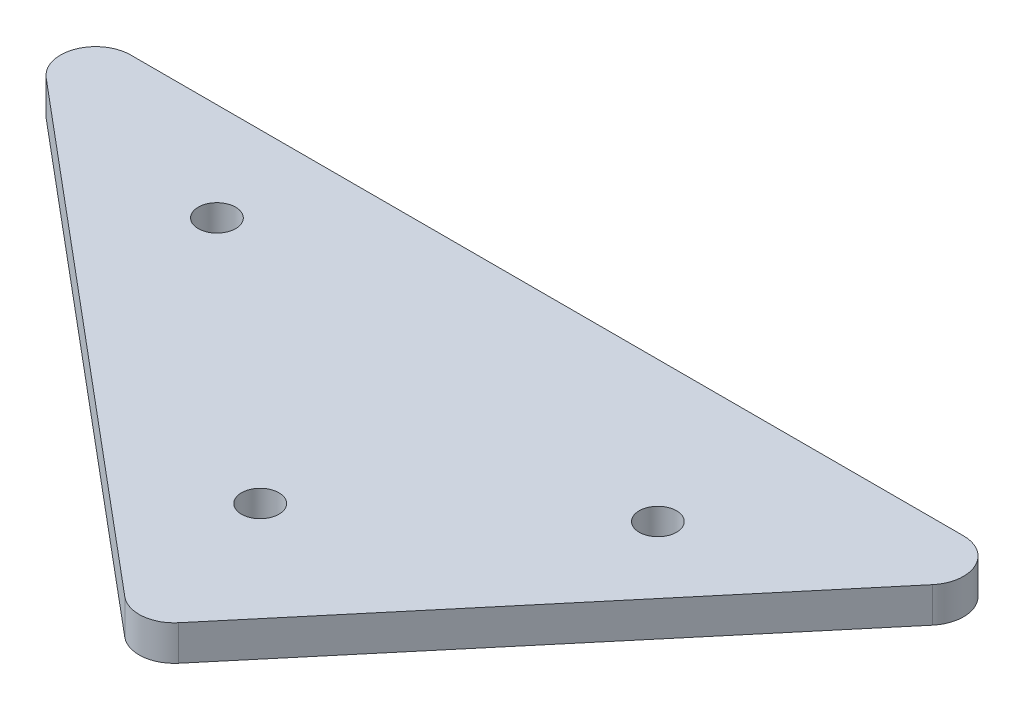
ISO-10303-21;
HEADER;
FILE_DESCRIPTION(('STEP AP214'),'2;1');
FILE_NAME('part.step','',(''),(''),'','','');
FILE_SCHEMA(('AUTOMOTIVE_DESIGN { 1 0 10303 214 1 1 1 1 }'));
ENDSEC;
DATA;
#1=APPLICATION_CONTEXT('core data for automotive mechanical design processes');
#2=APPLICATION_PROTOCOL_DEFINITION('international standard','automotive_design',2000,#1);
#3=PRODUCT_CONTEXT('',#1,'mechanical');
#4=PRODUCT('Part','Part','',(#3));
#5=PRODUCT_RELATED_PRODUCT_CATEGORY('part','',(#4));
#6=PRODUCT_DEFINITION_FORMATION('','',#4);
#7=PRODUCT_DEFINITION_CONTEXT('part definition',#1,'design');
#8=PRODUCT_DEFINITION('design','',#6,#7);
#9=PRODUCT_DEFINITION_SHAPE('','',#8);
#10=(LENGTH_UNIT() NAMED_UNIT(*) SI_UNIT(.MILLI.,.METRE.));
#11=(NAMED_UNIT(*) PLANE_ANGLE_UNIT() SI_UNIT($,.RADIAN.));
#12=(NAMED_UNIT(*) SI_UNIT($,.STERADIAN.) SOLID_ANGLE_UNIT());
#13=UNCERTAINTY_MEASURE_WITH_UNIT(LENGTH_MEASURE(1.E-05),#10,'distance_accuracy_value','');
#14=(GEOMETRIC_REPRESENTATION_CONTEXT(3) GLOBAL_UNCERTAINTY_ASSIGNED_CONTEXT((#13)) GLOBAL_UNIT_ASSIGNED_CONTEXT((#10,
#11,#12)) REPRESENTATION_CONTEXT('',''));
#15=CARTESIAN_POINT('',(0.,0.,0.));
#16=DIRECTION('',(0.,0.,1.));
#17=DIRECTION('',(1.,0.,0.));
#18=AXIS2_PLACEMENT_3D('',#15,#16,#17);
#19=CARTESIAN_POINT('',(189.795344434669,-158.75,127.));
#20=DIRECTION('',(0.,0.,1.));
#21=DIRECTION('',(1.,0.,0.));
#22=AXIS2_PLACEMENT_3D('',#19,#20,#21);
#23=PLANE('',#22);
#24=DIRECTION('',(-1.,0.,0.));
#25=VECTOR('',#24,1.);
#26=CARTESIAN_POINT('',(189.795344434669,-158.75,127.));
#27=LINE('',#26,#25);
#28=CARTESIAN_POINT('',(258.087229911123,-158.75,127.));
#29=VERTEX_POINT('',#28);
#30=CARTESIAN_POINT('',(107.476722517164,-158.75,127.));
#31=VERTEX_POINT('',#30);
#32=EDGE_CURVE('E106',#29,#31,#27,.T.);
#33=ORIENTED_EDGE('',*,*,#32,.F.);
#34=DIRECTION('',(0.,-1.,0.));
#35=VECTOR('',#34,1.);
#36=CARTESIAN_POINT('',(258.087229911123,-158.75,127.));
#37=LINE('',#36,#35);
#38=CARTESIAN_POINT('',(258.087229911123,-165.1,127.));
#39=VERTEX_POINT('',#38);
#40=EDGE_CURVE('E91',#29,#39,#37,.T.);
#41=ORIENTED_EDGE('',*,*,#40,.T.);
#42=DIRECTION('',(-1.,0.,0.));
#43=VECTOR('',#42,1.);
#44=CARTESIAN_POINT('',(189.795344434669,-165.1,127.));
#45=LINE('',#44,#43);
#46=CARTESIAN_POINT('',(107.476722517164,-165.1,127.));
#47=VERTEX_POINT('',#46);
#48=EDGE_CURVE('E104',#39,#47,#45,.T.);
#49=ORIENTED_EDGE('',*,*,#48,.T.);
#50=DIRECTION('',(0.,-1.,0.));
#51=VECTOR('',#50,1.);
#52=CARTESIAN_POINT('',(107.476722517164,-158.75,127.));
#53=LINE('',#52,#51);
#54=EDGE_CURVE('E109',#47,#31,#53,.F.);
#55=ORIENTED_EDGE('',*,*,#54,.T.);
#56=EDGE_LOOP('',(#33,#41,#49,#55));
#57=FACE_BOUND('',#56,.T.);
#58=ADVANCED_FACE('F16',(#57),#23,.F.);
#59=CARTESIAN_POINT('',(145.411840023669,-158.75,173.470679395635));
#60=DIRECTION('',(0.64278760968654,0.,-0.766044443118978));
#61=DIRECTION('',(-0.766044443118978,0.,-0.64278760968654));
#62=AXIS2_PLACEMENT_3D('',#59,#60,#61);
#63=PLANE('',#62);
#64=DIRECTION('',(0.766044443118978,0.,0.64278760968654));
#65=VECTOR('',#64,1.);
#66=CARTESIAN_POINT('',(145.411840023669,-165.1,173.470679395635));
#67=LINE('',#66,#65);
#68=CARTESIAN_POINT('',(103.395021195655,-165.1,138.214382213805));
#69=VERTEX_POINT('',#68);
#70=CARTESIAN_POINT('',(191.77689496586,-165.1,212.375579897142));
#71=VERTEX_POINT('',#70);
#72=EDGE_CURVE('E114',#69,#71,#67,.T.);
#73=ORIENTED_EDGE('',*,*,#72,.T.);
#74=DIRECTION('',(0.,-1.,0.));
#75=VECTOR('',#74,1.);
#76=CARTESIAN_POINT('',(191.77689496586,-158.75,212.375579897142));
#77=LINE('',#76,#75);
#78=CARTESIAN_POINT('',(191.77689496586,-158.75,212.375579897142));
#79=VERTEX_POINT('',#78);
#80=EDGE_CURVE('E11',#71,#79,#77,.F.);
#81=ORIENTED_EDGE('',*,*,#80,.T.);
#82=DIRECTION('',(0.766044443118978,0.,0.64278760968654));
#83=VECTOR('',#82,1.);
#84=CARTESIAN_POINT('',(145.411840023669,-158.75,173.470679395635));
#85=LINE('',#84,#83);
#86=CARTESIAN_POINT('',(103.395021195655,-158.75,138.214382213805));
#87=VERTEX_POINT('',#86);
#88=EDGE_CURVE('E143',#87,#79,#85,.T.);
#89=ORIENTED_EDGE('',*,*,#88,.F.);
#90=DIRECTION('',(0.,-1.,0.));
#91=VECTOR('',#90,1.);
#92=CARTESIAN_POINT('',(103.395021195655,-158.75,138.214382213805));
#93=LINE('',#92,#91);
#94=EDGE_CURVE('E25',#87,#69,#93,.T.);
#95=ORIENTED_EDGE('',*,*,#94,.T.);
#96=EDGE_LOOP('',(#73,#81,#89,#95));
#97=FACE_BOUND('',#96,.T.);
#98=ADVANCED_FACE('F164',(#97),#63,.F.);
#99=CARTESIAN_POINT('',(227.155076417816,-158.75,180.092351352888));
#100=DIRECTION('',(-0.766044443118978,0.,-0.64278760968654));
#101=DIRECTION('',(-0.64278760968654,0.,0.766044443118978));
#102=AXIS2_PLACEMENT_3D('',#99,#100,#101);
#103=PLANE('',#102);
#104=DIRECTION('',(0.64278760968654,0.,-0.766044443118978));
#105=VECTOR('',#104,1.);
#106=CARTESIAN_POINT('',(227.155076417816,-165.1,180.092351352888));
#107=LINE('',#106,#105);
#108=CARTESIAN_POINT('',(200.722978501176,-165.1,211.592899004846));
#109=VERTEX_POINT('',#108);
#110=CARTESIAN_POINT('',(262.951612124928,-165.1,137.431701321509));
#111=VERTEX_POINT('',#110);
#112=EDGE_CURVE('E115',#109,#111,#107,.T.);
#113=ORIENTED_EDGE('',*,*,#112,.T.);
#114=DIRECTION('',(0.,-1.,0.));
#115=VECTOR('',#114,1.);
#116=CARTESIAN_POINT('',(262.951612124928,-158.75,137.431701321509));
#117=LINE('',#116,#115);
#118=CARTESIAN_POINT('',(262.951612124928,-158.75,137.431701321509));
#119=VERTEX_POINT('',#118);
#120=EDGE_CURVE('E92',#111,#119,#117,.F.);
#121=ORIENTED_EDGE('',*,*,#120,.T.);
#122=DIRECTION('',(0.64278760968654,0.,-0.766044443118978));
#123=VECTOR('',#122,1.);
#124=CARTESIAN_POINT('',(227.155076417816,-158.75,180.092351352888));
#125=LINE('',#124,#123);
#126=CARTESIAN_POINT('',(200.722978501176,-158.75,211.592899004846));
#127=VERTEX_POINT('',#126);
#128=EDGE_CURVE('E121',#127,#119,#125,.T.);
#129=ORIENTED_EDGE('',*,*,#128,.F.);
#130=DIRECTION('',(0.,-1.,0.));
#131=VECTOR('',#130,1.);
#132=CARTESIAN_POINT('',(200.722978501176,-158.75,211.592899004846));
#133=LINE('',#132,#131);
#134=EDGE_CURVE('E98',#127,#109,#133,.T.);
#135=ORIENTED_EDGE('',*,*,#134,.T.);
#136=EDGE_LOOP('',(#113,#121,#129,#135));
#137=FACE_BOUND('',#136,.T.);
#138=ADVANCED_FACE('F172',(#137),#103,.F.);
#139=CARTESIAN_POINT('',(705.053366952356,-158.75,637.655198226429));
#140=DIRECTION('',(0.,1.,0.));
#141=DIRECTION('',(-1.,0.,0.));
#142=AXIS2_PLACEMENT_3D('',#139,#140,#141);
#143=PLANE('',#142);
#144=CARTESIAN_POINT('',(140.785030150917,-158.75,144.720316076102));
#145=DIRECTION('',(0.,1.,0.));
#146=DIRECTION('',(0.,0.,1.));
#147=AXIS2_PLACEMENT_3D('',#144,#145,#146);
#148=CIRCLE('',#147,3.3782);
#149=CARTESIAN_POINT('',(140.785030150917,-158.75,148.098516076102));
#150=VERTEX_POINT('',#149);
#151=EDGE_CURVE('E137',#150,#150,#148,.F.);
#152=ORIENTED_EDGE('',*,*,#151,.T.);
#153=EDGE_LOOP('',(#152));
#154=FACE_BOUND('',#153,.T.);
#155=CARTESIAN_POINT('',(228.210699023183,-158.75,152.4));
#156=DIRECTION('',(0.,1.,0.));
#157=DIRECTION('',(0.,0.,1.));
#158=AXIS2_PLACEMENT_3D('',#155,#156,#157);
#159=CIRCLE('',#158,3.3782);
#160=CARTESIAN_POINT('',(228.210699023183,-158.75,155.7782));
#161=VERTEX_POINT('',#160);
#162=EDGE_CURVE('E132',#161,#161,#159,.F.);
#163=ORIENTED_EDGE('',*,*,#162,.T.);
#164=EDGE_LOOP('',(#163));
#165=FACE_BOUND('',#164,.T.);
#166=CARTESIAN_POINT('',(189.428852288973,-158.75,185.537329291197));
#167=DIRECTION('',(0.,1.,0.));
#168=DIRECTION('',(0.,0.,1.));
#169=AXIS2_PLACEMENT_3D('',#166,#167,#168);
#170=CIRCLE('',#169,3.3782);
#171=CARTESIAN_POINT('',(189.428852288973,-158.75,188.915529291197));
#172=VERTEX_POINT('',#171);
#173=EDGE_CURVE('E124',#172,#172,#170,.F.);
#174=ORIENTED_EDGE('',*,*,#173,.T.);
#175=EDGE_LOOP('',(#174));
#176=FACE_BOUND('',#175,.T.);
#177=ORIENTED_EDGE('',*,*,#128,.T.);
#178=CARTESIAN_POINT('',(258.087229911123,-158.75,133.35));
#179=DIRECTION('',(0.,1.,0.));
#180=DIRECTION('',(0.,0.,1.));
#181=AXIS2_PLACEMENT_3D('',#178,#179,#180);
#182=CIRCLE('',#181,6.35);
#183=EDGE_CURVE('E158',#119,#29,#182,.T.);
#184=ORIENTED_EDGE('',*,*,#183,.T.);
#185=ORIENTED_EDGE('',*,*,#32,.T.);
#186=CARTESIAN_POINT('',(107.476722517164,-158.75,133.35));
#187=DIRECTION('',(0.,1.,0.));
#188=DIRECTION('',(0.,0.,1.));
#189=AXIS2_PLACEMENT_3D('',#186,#187,#188);
#190=CIRCLE('',#189,6.35);
#191=EDGE_CURVE('E45',#31,#87,#190,.T.);
#192=ORIENTED_EDGE('',*,*,#191,.T.);
#193=ORIENTED_EDGE('',*,*,#88,.T.);
#194=CARTESIAN_POINT('',(195.85859628737,-158.75,207.511197683337));
#195=DIRECTION('',(0.,1.,0.));
#196=DIRECTION('',(0.,0.,1.));
#197=AXIS2_PLACEMENT_3D('',#194,#195,#196);
#198=CIRCLE('',#197,6.35);
#199=EDGE_CURVE('E156',#79,#127,#198,.T.);
#200=ORIENTED_EDGE('',*,*,#199,.T.);
#201=EDGE_LOOP('',(#177,#184,#185,#192,#193,#200));
#202=FACE_BOUND('',#201,.T.);
#203=ADVANCED_FACE('F183',(#154,#165,#176,#202),#143,.T.);
#204=CARTESIAN_POINT('',(705.053366952356,-165.1,637.655198226429));
#205=DIRECTION('',(0.,1.,0.));
#206=DIRECTION('',(-1.,0.,0.));
#207=AXIS2_PLACEMENT_3D('',#204,#205,#206);
#208=PLANE('',#207);
#209=CARTESIAN_POINT('',(140.785030150917,-165.1,144.720316076102));
#210=DIRECTION('',(0.,-1.,0.));
#211=DIRECTION('',(0.,0.,-1.));
#212=AXIS2_PLACEMENT_3D('',#209,#210,#211);
#213=CIRCLE('',#212,3.3782);
#214=CARTESIAN_POINT('',(140.785030150917,-165.1,141.342116076102));
#215=VERTEX_POINT('',#214);
#216=EDGE_CURVE('E141',#215,#215,#213,.T.);
#217=ORIENTED_EDGE('',*,*,#216,.F.);
#218=EDGE_LOOP('',(#217));
#219=FACE_BOUND('',#218,.T.);
#220=CARTESIAN_POINT('',(228.210699023183,-165.1,152.4));
#221=DIRECTION('',(0.,-1.,0.));
#222=DIRECTION('',(0.,0.,-1.));
#223=AXIS2_PLACEMENT_3D('',#220,#221,#222);
#224=CIRCLE('',#223,3.3782);
#225=CARTESIAN_POINT('',(228.210699023183,-165.1,149.0218));
#226=VERTEX_POINT('',#225);
#227=EDGE_CURVE('E136',#226,#226,#224,.T.);
#228=ORIENTED_EDGE('',*,*,#227,.F.);
#229=EDGE_LOOP('',(#228));
#230=FACE_BOUND('',#229,.T.);
#231=CARTESIAN_POINT('',(189.428852288973,-165.1,185.537329291197));
#232=DIRECTION('',(0.,-1.,0.));
#233=DIRECTION('',(0.,0.,-1.));
#234=AXIS2_PLACEMENT_3D('',#231,#232,#233);
#235=CIRCLE('',#234,3.3782);
#236=CARTESIAN_POINT('',(189.428852288973,-165.1,182.159129291197));
#237=VERTEX_POINT('',#236);
#238=EDGE_CURVE('E131',#237,#237,#235,.T.);
#239=ORIENTED_EDGE('',*,*,#238,.F.);
#240=EDGE_LOOP('',(#239));
#241=FACE_BOUND('',#240,.T.);
#242=ORIENTED_EDGE('',*,*,#48,.F.);
#243=CARTESIAN_POINT('',(258.087229911123,-165.1,133.35));
#244=DIRECTION('',(0.,1.,0.));
#245=DIRECTION('',(0.,0.,1.));
#246=AXIS2_PLACEMENT_3D('',#243,#244,#245);
#247=CIRCLE('',#246,6.35);
#248=EDGE_CURVE('E87',#39,#111,#247,.F.);
#249=ORIENTED_EDGE('',*,*,#248,.T.);
#250=ORIENTED_EDGE('',*,*,#112,.F.);
#251=CARTESIAN_POINT('',(195.85859628737,-165.1,207.511197683337));
#252=DIRECTION('',(0.,1.,0.));
#253=DIRECTION('',(0.,0.,1.));
#254=AXIS2_PLACEMENT_3D('',#251,#252,#253);
#255=CIRCLE('',#254,6.35);
#256=EDGE_CURVE('E99',#109,#71,#255,.F.);
#257=ORIENTED_EDGE('',*,*,#256,.T.);
#258=ORIENTED_EDGE('',*,*,#72,.F.);
#259=CARTESIAN_POINT('',(107.476722517164,-165.1,133.35));
#260=DIRECTION('',(0.,1.,0.));
#261=DIRECTION('',(0.,0.,1.));
#262=AXIS2_PLACEMENT_3D('',#259,#260,#261);
#263=CIRCLE('',#262,6.35);
#264=EDGE_CURVE('E108',#69,#47,#263,.F.);
#265=ORIENTED_EDGE('',*,*,#264,.T.);
#266=EDGE_LOOP('',(#242,#249,#250,#257,#258,#265));
#267=FACE_BOUND('',#266,.T.);
#268=ADVANCED_FACE('F111',(#219,#230,#241,#267),#208,.F.);
#269=CARTESIAN_POINT('',(189.428852288973,38.5194319771191,185.537329291197));
#270=DIRECTION('',(0.,-1.,0.));
#271=DIRECTION('',(0.,0.,-1.));
#272=AXIS2_PLACEMENT_3D('',#269,#270,#271);
#273=CYLINDRICAL_SURFACE('',#272,3.3782);
#274=ORIENTED_EDGE('',*,*,#173,.F.);
#275=EDGE_LOOP('',(#274));
#276=FACE_BOUND('',#275,.T.);
#277=ORIENTED_EDGE('',*,*,#238,.T.);
#278=EDGE_LOOP('',(#277));
#279=FACE_BOUND('',#278,.T.);
#280=ADVANCED_FACE('F192',(#276,#279),#273,.F.);
#281=CARTESIAN_POINT('',(228.210699023183,38.5194319771191,152.4));
#282=DIRECTION('',(0.,-1.,0.));
#283=DIRECTION('',(0.,0.,-1.));
#284=AXIS2_PLACEMENT_3D('',#281,#282,#283);
#285=CYLINDRICAL_SURFACE('',#284,3.3782);
#286=ORIENTED_EDGE('',*,*,#162,.F.);
#287=EDGE_LOOP('',(#286));
#288=FACE_BOUND('',#287,.T.);
#289=ORIENTED_EDGE('',*,*,#227,.T.);
#290=EDGE_LOOP('',(#289));
#291=FACE_BOUND('',#290,.T.);
#292=ADVANCED_FACE('F239',(#288,#291),#285,.F.);
#293=CARTESIAN_POINT('',(140.785030150917,38.5194319771191,144.720316076102));
#294=DIRECTION('',(0.,-1.,0.));
#295=DIRECTION('',(0.,0.,-1.));
#296=AXIS2_PLACEMENT_3D('',#293,#294,#295);
#297=CYLINDRICAL_SURFACE('',#296,3.3782);
#298=ORIENTED_EDGE('',*,*,#151,.F.);
#299=EDGE_LOOP('',(#298));
#300=FACE_BOUND('',#299,.T.);
#301=ORIENTED_EDGE('',*,*,#216,.T.);
#302=EDGE_LOOP('',(#301));
#303=FACE_BOUND('',#302,.T.);
#304=ADVANCED_FACE('F206',(#300,#303),#297,.F.);
#305=CARTESIAN_POINT('',(258.087229911123,-158.75,133.35));
#306=DIRECTION('',(0.,-1.,0.));
#307=DIRECTION('',(0.,0.,-1.));
#308=AXIS2_PLACEMENT_3D('',#305,#306,#307);
#309=CYLINDRICAL_SURFACE('',#308,6.35);
#310=ORIENTED_EDGE('',*,*,#183,.F.);
#311=ORIENTED_EDGE('',*,*,#120,.F.);
#312=ORIENTED_EDGE('',*,*,#248,.F.);
#313=ORIENTED_EDGE('',*,*,#40,.F.);
#314=EDGE_LOOP('',(#310,#311,#312,#313));
#315=FACE_BOUND('',#314,.T.);
#316=ADVANCED_FACE('F90',(#315),#309,.T.);
#317=CARTESIAN_POINT('',(195.85859628737,-158.75,207.511197683337));
#318=DIRECTION('',(0.,-1.,0.));
#319=DIRECTION('',(0.,0.,-1.));
#320=AXIS2_PLACEMENT_3D('',#317,#318,#319);
#321=CYLINDRICAL_SURFACE('',#320,6.35);
#322=ORIENTED_EDGE('',*,*,#199,.F.);
#323=ORIENTED_EDGE('',*,*,#80,.F.);
#324=ORIENTED_EDGE('',*,*,#256,.F.);
#325=ORIENTED_EDGE('',*,*,#134,.F.);
#326=EDGE_LOOP('',(#322,#323,#324,#325));
#327=FACE_BOUND('',#326,.T.);
#328=ADVANCED_FACE('F169',(#327),#321,.T.);
#329=CARTESIAN_POINT('',(107.476722517164,-158.75,133.35));
#330=DIRECTION('',(0.,-1.,0.));
#331=DIRECTION('',(0.,0.,-1.));
#332=AXIS2_PLACEMENT_3D('',#329,#330,#331);
#333=CYLINDRICAL_SURFACE('',#332,6.35);
#334=ORIENTED_EDGE('',*,*,#191,.F.);
#335=ORIENTED_EDGE('',*,*,#54,.F.);
#336=ORIENTED_EDGE('',*,*,#264,.F.);
#337=ORIENTED_EDGE('',*,*,#94,.F.);
#338=EDGE_LOOP('',(#334,#335,#336,#337));
#339=FACE_BOUND('',#338,.T.);
#340=ADVANCED_FACE('F18',(#339),#333,.T.);
#341=CLOSED_SHELL('',(#58,#98,#138,#203,#268,#280,#292,#304,#316,#328,#340));
#342=MANIFOLD_SOLID_BREP('B1',#341);
#343=ADVANCED_BREP_SHAPE_REPRESENTATION('',(#18,#342),#14);
#344=SHAPE_DEFINITION_REPRESENTATION(#9,#343);
ENDSEC;
END-ISO-10303-21;
